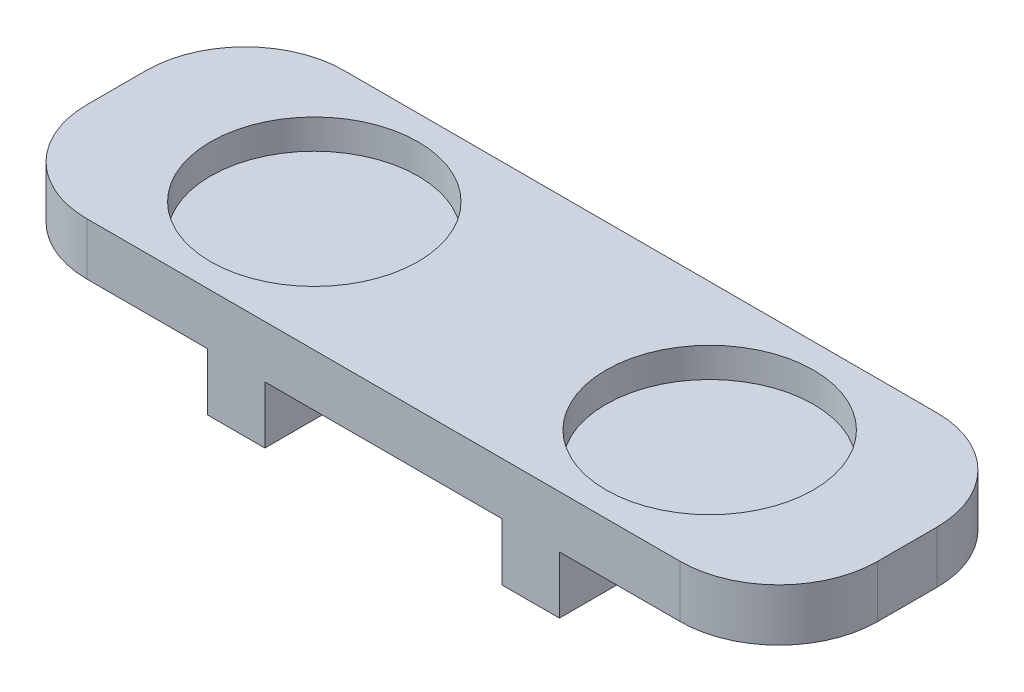
ISO-10303-21;
HEADER;
FILE_DESCRIPTION(('STEP AP214'),'2;1');
FILE_NAME('part.step','',(''),(''),'','','');
FILE_SCHEMA(('AUTOMOTIVE_DESIGN { 1 0 10303 214 1 1 1 1 }'));
ENDSEC;
DATA;
#1=APPLICATION_CONTEXT('core data for automotive mechanical design processes');
#2=APPLICATION_PROTOCOL_DEFINITION('international standard','automotive_design',2000,#1);
#3=PRODUCT_CONTEXT('',#1,'mechanical');
#4=PRODUCT('Part','Part','',(#3));
#5=PRODUCT_RELATED_PRODUCT_CATEGORY('part','',(#4));
#6=PRODUCT_DEFINITION_FORMATION('','',#4);
#7=PRODUCT_DEFINITION_CONTEXT('part definition',#1,'design');
#8=PRODUCT_DEFINITION('design','',#6,#7);
#9=PRODUCT_DEFINITION_SHAPE('','',#8);
#10=(LENGTH_UNIT() NAMED_UNIT(*) SI_UNIT(.MILLI.,.METRE.));
#11=(NAMED_UNIT(*) PLANE_ANGLE_UNIT() SI_UNIT($,.RADIAN.));
#12=(NAMED_UNIT(*) SI_UNIT($,.STERADIAN.) SOLID_ANGLE_UNIT());
#13=UNCERTAINTY_MEASURE_WITH_UNIT(LENGTH_MEASURE(1.E-05),#10,'distance_accuracy_value','');
#14=(GEOMETRIC_REPRESENTATION_CONTEXT(3) GLOBAL_UNCERTAINTY_ASSIGNED_CONTEXT((#13)) GLOBAL_UNIT_ASSIGNED_CONTEXT((#10,
#11,#12)) REPRESENTATION_CONTEXT('',''));
#15=CARTESIAN_POINT('',(0.,0.,0.));
#16=DIRECTION('',(0.,0.,1.));
#17=DIRECTION('',(1.,0.,0.));
#18=AXIS2_PLACEMENT_3D('',#15,#16,#17);
#19=CARTESIAN_POINT('',(0.,0.,33.02));
#20=DIRECTION('',(0.,-1.,0.));
#21=DIRECTION('',(1.,0.,0.));
#22=AXIS2_PLACEMENT_3D('',#19,#20,#21);
#23=PLANE('',#22);
#24=DIRECTION('',(-1.,0.,0.));
#25=VECTOR('',#24,1.);
#26=CARTESIAN_POINT('',(0.,0.,0.));
#27=LINE('',#26,#25);
#28=CARTESIAN_POINT('',(102.102268650145,0.,0.));
#29=VERTEX_POINT('',#28);
#30=CARTESIAN_POINT('',(86.6082686501452,0.,0.));
#31=VERTEX_POINT('',#30);
#32=EDGE_CURVE('E200',#29,#31,#27,.T.);
#33=ORIENTED_EDGE('',*,*,#32,.F.);
#34=CARTESIAN_POINT('',(102.102268650145,0.,12.7));
#35=DIRECTION('',(0.,-1.,0.));
#36=DIRECTION('',(1.,0.,0.));
#37=AXIS2_PLACEMENT_3D('',#34,#35,#36);
#38=CIRCLE('',#37,12.7);
#39=CARTESIAN_POINT('',(114.802268650145,0.,12.7));
#40=VERTEX_POINT('',#39);
#41=EDGE_CURVE('E253',#29,#40,#38,.T.);
#42=ORIENTED_EDGE('',*,*,#41,.T.);
#43=DIRECTION('',(0.,0.,-1.));
#44=VECTOR('',#43,1.);
#45=CARTESIAN_POINT('',(114.802268650145,0.,33.02));
#46=LINE('',#45,#44);
#47=CARTESIAN_POINT('',(114.802268650145,0.,20.32));
#48=VERTEX_POINT('',#47);
#49=EDGE_CURVE('E242',#48,#40,#46,.T.);
#50=ORIENTED_EDGE('',*,*,#49,.F.);
#51=CARTESIAN_POINT('',(102.102268650145,0.,20.32));
#52=DIRECTION('',(0.,-1.,0.));
#53=DIRECTION('',(1.,0.,0.));
#54=AXIS2_PLACEMENT_3D('',#51,#52,#53);
#55=CIRCLE('',#54,12.7);
#56=CARTESIAN_POINT('',(102.102268650145,0.,33.02));
#57=VERTEX_POINT('',#56);
#58=EDGE_CURVE('E251',#48,#57,#55,.T.);
#59=ORIENTED_EDGE('',*,*,#58,.T.);
#60=DIRECTION('',(-1.,0.,0.));
#61=VECTOR('',#60,1.);
#62=CARTESIAN_POINT('',(0.,0.,33.02));
#63=LINE('',#62,#61);
#64=CARTESIAN_POINT('',(86.6082686501452,0.,33.02));
#65=VERTEX_POINT('',#64);
#66=EDGE_CURVE('E176',#57,#65,#63,.T.);
#67=ORIENTED_EDGE('',*,*,#66,.T.);
#68=DIRECTION('',(0.,0.,-1.));
#69=VECTOR('',#68,1.);
#70=CARTESIAN_POINT('',(86.6082686501452,0.,33.02));
#71=LINE('',#70,#69);
#72=EDGE_CURVE('E199',#65,#31,#71,.T.);
#73=ORIENTED_EDGE('',*,*,#72,.T.);
#74=EDGE_LOOP('',(#33,#42,#50,#59,#67,#73));
#75=FACE_BOUND('',#74,.T.);
#76=ADVANCED_FACE('F37',(#75),#23,.T.);
#77=CARTESIAN_POINT('',(114.802268650145,0.,33.02));
#78=DIRECTION('',(1.,0.,0.));
#79=DIRECTION('',(0.,0.,-1.));
#80=AXIS2_PLACEMENT_3D('',#77,#78,#79);
#81=PLANE('',#80);
#82=ORIENTED_EDGE('',*,*,#49,.T.);
#83=DIRECTION('',(0.,-1.,0.));
#84=VECTOR('',#83,1.);
#85=CARTESIAN_POINT('',(114.802268650145,6.70926848629316,12.7));
#86=LINE('',#85,#84);
#87=CARTESIAN_POINT('',(114.802268650145,6.70926848629316,12.7));
#88=VERTEX_POINT('',#87);
#89=EDGE_CURVE('E258',#40,#88,#86,.F.);
#90=ORIENTED_EDGE('',*,*,#89,.T.);
#91=DIRECTION('',(0.,0.,-1.));
#92=VECTOR('',#91,1.);
#93=CARTESIAN_POINT('',(114.802268650145,6.70926848629316,33.02));
#94=LINE('',#93,#92);
#95=CARTESIAN_POINT('',(114.802268650145,6.70926848629316,20.32));
#96=VERTEX_POINT('',#95);
#97=EDGE_CURVE('E239',#96,#88,#94,.T.);
#98=ORIENTED_EDGE('',*,*,#97,.F.);
#99=DIRECTION('',(0.,-1.,0.));
#100=VECTOR('',#99,1.);
#101=CARTESIAN_POINT('',(114.802268650145,0.,20.32));
#102=LINE('',#101,#100);
#103=EDGE_CURVE('E255',#96,#48,#102,.T.);
#104=ORIENTED_EDGE('',*,*,#103,.T.);
#105=EDGE_LOOP('',(#82,#90,#98,#104));
#106=FACE_BOUND('',#105,.T.);
#107=ADVANCED_FACE('F320',(#106),#81,.T.);
#108=CARTESIAN_POINT('',(0.,6.70926848629316,33.02));
#109=DIRECTION('',(0.,1.,0.));
#110=DIRECTION('',(0.,0.,1.));
#111=AXIS2_PLACEMENT_3D('',#108,#109,#110);
#112=PLANE('',#111);
#113=CARTESIAN_POINT('',(38.6022686501452,6.70926848629316,16.51));
#114=DIRECTION('',(0.,1.,0.));
#115=DIRECTION('',(0.,0.,1.));
#116=AXIS2_PLACEMENT_3D('',#113,#114,#115);
#117=CIRCLE('',#116,13.335);
#118=CARTESIAN_POINT('',(38.6022686501452,6.70926848629316,29.845));
#119=VERTEX_POINT('',#118);
#120=EDGE_CURVE('E607',#119,#119,#117,.T.);
#121=ORIENTED_EDGE('',*,*,#120,.F.);
#122=EDGE_LOOP('',(#121));
#123=FACE_BOUND('',#122,.T.);
#124=CARTESIAN_POINT('',(89.4022686501452,6.70926848629316,16.51));
#125=DIRECTION('',(0.,1.,0.));
#126=DIRECTION('',(0.,0.,1.));
#127=AXIS2_PLACEMENT_3D('',#124,#125,#126);
#128=CIRCLE('',#127,13.335);
#129=CARTESIAN_POINT('',(89.4022686501452,6.70926848629316,29.845));
#130=VERTEX_POINT('',#129);
#131=EDGE_CURVE('E605',#130,#130,#128,.T.);
#132=ORIENTED_EDGE('',*,*,#131,.F.);
#133=EDGE_LOOP('',(#132));
#134=FACE_BOUND('',#133,.T.);
#135=ORIENTED_EDGE('',*,*,#97,.T.);
#136=CARTESIAN_POINT('',(102.102268650145,6.70926848629316,12.7));
#137=DIRECTION('',(0.,1.,0.));
#138=DIRECTION('',(0.,0.,1.));
#139=AXIS2_PLACEMENT_3D('',#136,#137,#138);
#140=CIRCLE('',#139,12.7);
#141=CARTESIAN_POINT('',(102.102268650145,6.70926848629316,0.));
#142=VERTEX_POINT('',#141);
#143=EDGE_CURVE('E266',#88,#142,#140,.T.);
#144=ORIENTED_EDGE('',*,*,#143,.T.);
#145=DIRECTION('',(1.,0.,0.));
#146=VECTOR('',#145,1.);
#147=CARTESIAN_POINT('',(0.,6.70926848629316,0.));
#148=LINE('',#147,#146);
#149=CARTESIAN_POINT('',(25.9022686501452,6.70926848629316,0.));
#150=VERTEX_POINT('',#149);
#151=EDGE_CURVE('E202',#150,#142,#148,.T.);
#152=ORIENTED_EDGE('',*,*,#151,.F.);
#153=CARTESIAN_POINT('',(25.9022686501452,6.70926848629316,12.7));
#154=DIRECTION('',(0.,1.,0.));
#155=DIRECTION('',(0.,0.,1.));
#156=AXIS2_PLACEMENT_3D('',#153,#154,#155);
#157=CIRCLE('',#156,12.7);
#158=CARTESIAN_POINT('',(13.2022686501452,6.70926848629316,12.7));
#159=VERTEX_POINT('',#158);
#160=EDGE_CURVE('E262',#150,#159,#157,.T.);
#161=ORIENTED_EDGE('',*,*,#160,.T.);
#162=DIRECTION('',(0.,0.,-1.));
#163=VECTOR('',#162,1.);
#164=CARTESIAN_POINT('',(13.2022686501452,6.70926848629316,33.02));
#165=LINE('',#164,#163);
#166=CARTESIAN_POINT('',(13.2022686501452,6.70926848629316,20.32));
#167=VERTEX_POINT('',#166);
#168=EDGE_CURVE('E237',#167,#159,#165,.T.);
#169=ORIENTED_EDGE('',*,*,#168,.F.);
#170=CARTESIAN_POINT('',(25.9022686501452,6.70926848629316,20.32));
#171=DIRECTION('',(0.,1.,0.));
#172=DIRECTION('',(0.,0.,1.));
#173=AXIS2_PLACEMENT_3D('',#170,#171,#172);
#174=CIRCLE('',#173,12.7);
#175=CARTESIAN_POINT('',(25.9022686501452,6.70926848629316,33.02));
#176=VERTEX_POINT('',#175);
#177=EDGE_CURVE('E260',#167,#176,#174,.T.);
#178=ORIENTED_EDGE('',*,*,#177,.T.);
#179=DIRECTION('',(1.,0.,0.));
#180=VECTOR('',#179,1.);
#181=CARTESIAN_POINT('',(0.,6.70926848629316,33.02));
#182=LINE('',#181,#180);
#183=CARTESIAN_POINT('',(102.102268650145,6.70926848629316,33.02));
#184=VERTEX_POINT('',#183);
#185=EDGE_CURVE('E174',#176,#184,#182,.T.);
#186=ORIENTED_EDGE('',*,*,#185,.T.);
#187=CARTESIAN_POINT('',(102.102268650145,6.70926848629316,20.32));
#188=DIRECTION('',(0.,1.,0.));
#189=DIRECTION('',(0.,0.,1.));
#190=AXIS2_PLACEMENT_3D('',#187,#188,#189);
#191=CIRCLE('',#190,12.7);
#192=EDGE_CURVE('E264',#184,#96,#191,.T.);
#193=ORIENTED_EDGE('',*,*,#192,.T.);
#194=EDGE_LOOP('',(#135,#144,#152,#161,#169,#178,#186,#193));
#195=FACE_BOUND('',#194,.T.);
#196=ADVANCED_FACE('F279',(#123,#134,#195),#112,.T.);
#197=CARTESIAN_POINT('',(13.2022686501452,0.,33.02));
#198=DIRECTION('',(-1.,0.,0.));
#199=DIRECTION('',(0.,0.,1.));
#200=AXIS2_PLACEMENT_3D('',#197,#198,#199);
#201=PLANE('',#200);
#202=ORIENTED_EDGE('',*,*,#168,.T.);
#203=DIRECTION('',(0.,1.,0.));
#204=VECTOR('',#203,1.);
#205=CARTESIAN_POINT('',(13.2022686501452,0.,12.7));
#206=LINE('',#205,#204);
#207=CARTESIAN_POINT('',(13.2022686501452,0.,12.7));
#208=VERTEX_POINT('',#207);
#209=EDGE_CURVE('E52',#159,#208,#206,.F.);
#210=ORIENTED_EDGE('',*,*,#209,.T.);
#211=DIRECTION('',(0.,0.,-1.));
#212=VECTOR('',#211,1.);
#213=CARTESIAN_POINT('',(13.2022686501452,0.,33.02));
#214=LINE('',#213,#212);
#215=CARTESIAN_POINT('',(13.2022686501452,0.,20.32));
#216=VERTEX_POINT('',#215);
#217=EDGE_CURVE('E158',#216,#208,#214,.T.);
#218=ORIENTED_EDGE('',*,*,#217,.F.);
#219=DIRECTION('',(0.,1.,0.));
#220=VECTOR('',#219,1.);
#221=CARTESIAN_POINT('',(13.2022686501452,0.,20.32));
#222=LINE('',#221,#220);
#223=EDGE_CURVE('E271',#216,#167,#222,.T.);
#224=ORIENTED_EDGE('',*,*,#223,.T.);
#225=EDGE_LOOP('',(#202,#210,#218,#224));
#226=FACE_BOUND('',#225,.T.);
#227=ADVANCED_FACE('F276',(#226),#201,.T.);
#228=ORIENTED_EDGE('',*,*,#217,.T.);
#229=CARTESIAN_POINT('',(25.9022686501452,0.,12.7));
#230=DIRECTION('',(0.,-1.,0.));
#231=DIRECTION('',(1.,0.,0.));
#232=AXIS2_PLACEMENT_3D('',#229,#230,#231);
#233=CIRCLE('',#232,12.7);
#234=CARTESIAN_POINT('',(25.9022686501452,0.,0.));
#235=VERTEX_POINT('',#234);
#236=EDGE_CURVE('E11',#208,#235,#233,.T.);
#237=ORIENTED_EDGE('',*,*,#236,.T.);
#238=CARTESIAN_POINT('',(41.3962686501452,0.,0.));
#239=VERTEX_POINT('',#238);
#240=EDGE_CURVE('E154',#239,#235,#27,.T.);
#241=ORIENTED_EDGE('',*,*,#240,.F.);
#242=DIRECTION('',(0.,0.,-1.));
#243=VECTOR('',#242,1.);
#244=CARTESIAN_POINT('',(41.3962686501452,0.,33.02));
#245=LINE('',#244,#243);
#246=CARTESIAN_POINT('',(41.3962686501452,0.,33.02));
#247=VERTEX_POINT('',#246);
#248=EDGE_CURVE('E148',#247,#239,#245,.T.);
#249=ORIENTED_EDGE('',*,*,#248,.F.);
#250=CARTESIAN_POINT('',(25.9022686501452,0.,33.02));
#251=VERTEX_POINT('',#250);
#252=EDGE_CURVE('E152',#247,#251,#63,.T.);
#253=ORIENTED_EDGE('',*,*,#252,.T.);
#254=CARTESIAN_POINT('',(25.9022686501452,0.,20.32));
#255=DIRECTION('',(0.,-1.,0.));
#256=DIRECTION('',(1.,0.,0.));
#257=AXIS2_PLACEMENT_3D('',#254,#255,#256);
#258=CIRCLE('',#257,12.7);
#259=EDGE_CURVE('E45',#251,#216,#258,.T.);
#260=ORIENTED_EDGE('',*,*,#259,.T.);
#261=EDGE_LOOP('',(#228,#237,#241,#249,#253,#260));
#262=FACE_BOUND('',#261,.T.);
#263=ADVANCED_FACE('F150',(#262),#23,.T.);
#264=CARTESIAN_POINT('',(41.3962686501452,0.,33.02));
#265=DIRECTION('',(1.,0.,0.));
#266=DIRECTION('',(0.,0.,-1.));
#267=AXIS2_PLACEMENT_3D('',#264,#265,#266);
#268=PLANE('',#267);
#269=DIRECTION('',(0.,-1.,0.));
#270=VECTOR('',#269,1.);
#271=CARTESIAN_POINT('',(41.3962686501452,0.,0.));
#272=LINE('',#271,#270);
#273=CARTESIAN_POINT('',(41.3962686501452,-7.366,0.));
#274=VERTEX_POINT('',#273);
#275=EDGE_CURVE('E207',#239,#274,#272,.T.);
#276=ORIENTED_EDGE('',*,*,#275,.T.);
#277=DIRECTION('',(0.,0.,-1.));
#278=VECTOR('',#277,1.);
#279=CARTESIAN_POINT('',(41.3962686501452,-7.366,33.02));
#280=LINE('',#279,#278);
#281=CARTESIAN_POINT('',(41.3962686501452,-7.366,33.02));
#282=VERTEX_POINT('',#281);
#283=EDGE_CURVE('E159',#282,#274,#280,.T.);
#284=ORIENTED_EDGE('',*,*,#283,.F.);
#285=DIRECTION('',(0.,-1.,0.));
#286=VECTOR('',#285,1.);
#287=CARTESIAN_POINT('',(41.3962686501452,0.,33.02));
#288=LINE('',#287,#286);
#289=EDGE_CURVE('E162',#247,#282,#288,.T.);
#290=ORIENTED_EDGE('',*,*,#289,.F.);
#291=ORIENTED_EDGE('',*,*,#248,.T.);
#292=EDGE_LOOP('',(#276,#284,#290,#291));
#293=FACE_BOUND('',#292,.T.);
#294=ADVANCED_FACE('F163',(#293),#268,.F.);
#295=CARTESIAN_POINT('',(0.,-7.366,33.02));
#296=DIRECTION('',(0.,-1.,0.));
#297=DIRECTION('',(0.,0.,-1.));
#298=AXIS2_PLACEMENT_3D('',#295,#296,#297);
#299=PLANE('',#298);
#300=DIRECTION('',(-1.,0.,0.));
#301=VECTOR('',#300,1.);
#302=CARTESIAN_POINT('',(0.,-7.366,0.));
#303=LINE('',#302,#301);
#304=CARTESIAN_POINT('',(48.7622686501452,-7.366,0.));
#305=VERTEX_POINT('',#304);
#306=EDGE_CURVE('E209',#305,#274,#303,.T.);
#307=ORIENTED_EDGE('',*,*,#306,.F.);
#308=DIRECTION('',(0.,0.,-1.));
#309=VECTOR('',#308,1.);
#310=CARTESIAN_POINT('',(48.7622686501452,-7.366,33.02));
#311=LINE('',#310,#309);
#312=CARTESIAN_POINT('',(48.7622686501452,-7.366,33.02));
#313=VERTEX_POINT('',#312);
#314=EDGE_CURVE('E233',#313,#305,#311,.T.);
#315=ORIENTED_EDGE('',*,*,#314,.F.);
#316=DIRECTION('',(-1.,0.,0.));
#317=VECTOR('',#316,1.);
#318=CARTESIAN_POINT('',(0.,-7.366,33.02));
#319=LINE('',#318,#317);
#320=EDGE_CURVE('E167',#313,#282,#319,.T.);
#321=ORIENTED_EDGE('',*,*,#320,.T.);
#322=ORIENTED_EDGE('',*,*,#283,.T.);
#323=EDGE_LOOP('',(#307,#315,#321,#322));
#324=FACE_BOUND('',#323,.T.);
#325=ADVANCED_FACE('F298',(#324),#299,.T.);
#326=CARTESIAN_POINT('',(48.7622686501452,0.,33.02));
#327=DIRECTION('',(1.,0.,0.));
#328=DIRECTION('',(0.,0.,-1.));
#329=AXIS2_PLACEMENT_3D('',#326,#327,#328);
#330=PLANE('',#329);
#331=DIRECTION('',(0.,-1.,0.));
#332=VECTOR('',#331,1.);
#333=CARTESIAN_POINT('',(48.7622686501452,0.,0.));
#334=LINE('',#333,#332);
#335=CARTESIAN_POINT('',(48.7622686501452,0.,0.));
#336=VERTEX_POINT('',#335);
#337=EDGE_CURVE('E212',#336,#305,#334,.T.);
#338=ORIENTED_EDGE('',*,*,#337,.F.);
#339=DIRECTION('',(0.,0.,-1.));
#340=VECTOR('',#339,1.);
#341=CARTESIAN_POINT('',(48.7622686501452,0.,33.02));
#342=LINE('',#341,#340);
#343=CARTESIAN_POINT('',(48.7622686501452,0.,33.02));
#344=VERTEX_POINT('',#343);
#345=EDGE_CURVE('E231',#344,#336,#342,.T.);
#346=ORIENTED_EDGE('',*,*,#345,.F.);
#347=DIRECTION('',(0.,-1.,0.));
#348=VECTOR('',#347,1.);
#349=CARTESIAN_POINT('',(48.7622686501452,0.,33.02));
#350=LINE('',#349,#348);
#351=EDGE_CURVE('E184',#344,#313,#350,.T.);
#352=ORIENTED_EDGE('',*,*,#351,.T.);
#353=ORIENTED_EDGE('',*,*,#314,.T.);
#354=EDGE_LOOP('',(#338,#346,#352,#353));
#355=FACE_BOUND('',#354,.T.);
#356=ADVANCED_FACE('F295',(#355),#330,.T.);
#357=CARTESIAN_POINT('',(79.2422686501452,0.,0.));
#358=VERTEX_POINT('',#357);
#359=EDGE_CURVE('E204',#358,#336,#27,.T.);
#360=ORIENTED_EDGE('',*,*,#359,.F.);
#361=DIRECTION('',(0.,0.,-1.));
#362=VECTOR('',#361,1.);
#363=CARTESIAN_POINT('',(79.2422686501452,0.,33.02));
#364=LINE('',#363,#362);
#365=CARTESIAN_POINT('',(79.2422686501452,0.,33.02));
#366=VERTEX_POINT('',#365);
#367=EDGE_CURVE('E229',#366,#358,#364,.T.);
#368=ORIENTED_EDGE('',*,*,#367,.F.);
#369=EDGE_CURVE('E177',#366,#344,#63,.T.);
#370=ORIENTED_EDGE('',*,*,#369,.T.);
#371=ORIENTED_EDGE('',*,*,#345,.T.);
#372=EDGE_LOOP('',(#360,#368,#370,#371));
#373=FACE_BOUND('',#372,.T.);
#374=ADVANCED_FACE('F293',(#373),#23,.T.);
#375=CARTESIAN_POINT('',(79.2422686501452,0.,33.02));
#376=DIRECTION('',(1.,0.,0.));
#377=DIRECTION('',(0.,0.,-1.));
#378=AXIS2_PLACEMENT_3D('',#375,#376,#377);
#379=PLANE('',#378);
#380=DIRECTION('',(0.,-1.,0.));
#381=VECTOR('',#380,1.);
#382=CARTESIAN_POINT('',(79.2422686501452,0.,0.));
#383=LINE('',#382,#381);
#384=CARTESIAN_POINT('',(79.2422686501452,-7.366,0.));
#385=VERTEX_POINT('',#384);
#386=EDGE_CURVE('E215',#358,#385,#383,.T.);
#387=ORIENTED_EDGE('',*,*,#386,.T.);
#388=DIRECTION('',(0.,0.,-1.));
#389=VECTOR('',#388,1.);
#390=CARTESIAN_POINT('',(79.2422686501452,-7.366,33.02));
#391=LINE('',#390,#389);
#392=CARTESIAN_POINT('',(79.2422686501452,-7.366,33.02));
#393=VERTEX_POINT('',#392);
#394=EDGE_CURVE('E226',#393,#385,#391,.T.);
#395=ORIENTED_EDGE('',*,*,#394,.F.);
#396=DIRECTION('',(0.,-1.,0.));
#397=VECTOR('',#396,1.);
#398=CARTESIAN_POINT('',(79.2422686501452,0.,33.02));
#399=LINE('',#398,#397);
#400=EDGE_CURVE('E183',#366,#393,#399,.T.);
#401=ORIENTED_EDGE('',*,*,#400,.F.);
#402=ORIENTED_EDGE('',*,*,#367,.T.);
#403=EDGE_LOOP('',(#387,#395,#401,#402));
#404=FACE_BOUND('',#403,.T.);
#405=ADVANCED_FACE('F304',(#404),#379,.F.);
#406=CARTESIAN_POINT('',(0.,-7.366,33.02));
#407=DIRECTION('',(0.,1.,0.));
#408=DIRECTION('',(0.,0.,1.));
#409=AXIS2_PLACEMENT_3D('',#406,#407,#408);
#410=PLANE('',#409);
#411=DIRECTION('',(1.,0.,0.));
#412=VECTOR('',#411,1.);
#413=CARTESIAN_POINT('',(0.,-7.366,0.));
#414=LINE('',#413,#412);
#415=CARTESIAN_POINT('',(86.6082686501452,-7.366,0.));
#416=VERTEX_POINT('',#415);
#417=EDGE_CURVE('E217',#385,#416,#414,.T.);
#418=ORIENTED_EDGE('',*,*,#417,.T.);
#419=DIRECTION('',(0.,0.,-1.));
#420=VECTOR('',#419,1.);
#421=CARTESIAN_POINT('',(86.6082686501452,-7.366,33.02));
#422=LINE('',#421,#420);
#423=CARTESIAN_POINT('',(86.6082686501452,-7.366,33.02));
#424=VERTEX_POINT('',#423);
#425=EDGE_CURVE('E224',#424,#416,#422,.T.);
#426=ORIENTED_EDGE('',*,*,#425,.F.);
#427=DIRECTION('',(1.,0.,0.));
#428=VECTOR('',#427,1.);
#429=CARTESIAN_POINT('',(0.,-7.366,33.02));
#430=LINE('',#429,#428);
#431=EDGE_CURVE('E187',#393,#424,#430,.T.);
#432=ORIENTED_EDGE('',*,*,#431,.F.);
#433=ORIENTED_EDGE('',*,*,#394,.T.);
#434=EDGE_LOOP('',(#418,#426,#432,#433));
#435=FACE_BOUND('',#434,.T.);
#436=ADVANCED_FACE('F306',(#435),#410,.F.);
#437=CARTESIAN_POINT('',(86.6082686501452,0.,33.02));
#438=DIRECTION('',(1.,0.,0.));
#439=DIRECTION('',(0.,0.,-1.));
#440=AXIS2_PLACEMENT_3D('',#437,#438,#439);
#441=PLANE('',#440);
#442=DIRECTION('',(0.,-1.,0.));
#443=VECTOR('',#442,1.);
#444=CARTESIAN_POINT('',(86.6082686501452,0.,0.));
#445=LINE('',#444,#443);
#446=EDGE_CURVE('E181',#31,#416,#445,.T.);
#447=ORIENTED_EDGE('',*,*,#446,.F.);
#448=ORIENTED_EDGE('',*,*,#72,.F.);
#449=DIRECTION('',(0.,-1.,0.));
#450=VECTOR('',#449,1.);
#451=CARTESIAN_POINT('',(86.6082686501452,0.,33.02));
#452=LINE('',#451,#450);
#453=EDGE_CURVE('E196',#65,#424,#452,.T.);
#454=ORIENTED_EDGE('',*,*,#453,.T.);
#455=ORIENTED_EDGE('',*,*,#425,.T.);
#456=EDGE_LOOP('',(#447,#448,#454,#455));
#457=FACE_BOUND('',#456,.T.);
#458=ADVANCED_FACE('F310',(#457),#441,.T.);
#459=CARTESIAN_POINT('',(0.,0.,33.02));
#460=DIRECTION('',(0.,0.,1.));
#461=DIRECTION('',(1.,0.,0.));
#462=AXIS2_PLACEMENT_3D('',#459,#460,#461);
#463=PLANE('',#462);
#464=ORIENTED_EDGE('',*,*,#66,.F.);
#465=DIRECTION('',(0.,-1.,0.));
#466=VECTOR('',#465,1.);
#467=CARTESIAN_POINT('',(102.102268650145,0.,33.02));
#468=LINE('',#467,#466);
#469=EDGE_CURVE('E269',#57,#184,#468,.F.);
#470=ORIENTED_EDGE('',*,*,#469,.T.);
#471=ORIENTED_EDGE('',*,*,#185,.F.);
#472=DIRECTION('',(0.,1.,0.));
#473=VECTOR('',#472,1.);
#474=CARTESIAN_POINT('',(25.9022686501452,0.,33.02));
#475=LINE('',#474,#473);
#476=EDGE_CURVE('E173',#176,#251,#475,.F.);
#477=ORIENTED_EDGE('',*,*,#476,.T.);
#478=ORIENTED_EDGE('',*,*,#252,.F.);
#479=ORIENTED_EDGE('',*,*,#289,.T.);
#480=ORIENTED_EDGE('',*,*,#320,.F.);
#481=ORIENTED_EDGE('',*,*,#351,.F.);
#482=ORIENTED_EDGE('',*,*,#369,.F.);
#483=ORIENTED_EDGE('',*,*,#400,.T.);
#484=ORIENTED_EDGE('',*,*,#431,.T.);
#485=ORIENTED_EDGE('',*,*,#453,.F.);
#486=EDGE_LOOP('',(#464,#470,#471,#477,#478,#479,#480,#481,#482,#483,#484,#485));
#487=FACE_BOUND('',#486,.T.);
#488=ADVANCED_FACE('F170',(#487),#463,.T.);
#489=CARTESIAN_POINT('',(0.,0.,0.));
#490=DIRECTION('',(0.,0.,1.));
#491=DIRECTION('',(1.,0.,0.));
#492=AXIS2_PLACEMENT_3D('',#489,#490,#491);
#493=PLANE('',#492);
#494=ORIENTED_EDGE('',*,*,#151,.T.);
#495=DIRECTION('',(0.,-1.,0.));
#496=VECTOR('',#495,1.);
#497=CARTESIAN_POINT('',(102.102268650145,0.,0.));
#498=LINE('',#497,#496);
#499=EDGE_CURVE('E248',#142,#29,#498,.T.);
#500=ORIENTED_EDGE('',*,*,#499,.T.);
#501=ORIENTED_EDGE('',*,*,#32,.T.);
#502=ORIENTED_EDGE('',*,*,#446,.T.);
#503=ORIENTED_EDGE('',*,*,#417,.F.);
#504=ORIENTED_EDGE('',*,*,#386,.F.);
#505=ORIENTED_EDGE('',*,*,#359,.T.);
#506=ORIENTED_EDGE('',*,*,#337,.T.);
#507=ORIENTED_EDGE('',*,*,#306,.T.);
#508=ORIENTED_EDGE('',*,*,#275,.F.);
#509=ORIENTED_EDGE('',*,*,#240,.T.);
#510=DIRECTION('',(0.,1.,0.));
#511=VECTOR('',#510,1.);
#512=CARTESIAN_POINT('',(25.9022686501452,6.70926848629316,0.));
#513=LINE('',#512,#511);
#514=EDGE_CURVE('E245',#235,#150,#513,.T.);
#515=ORIENTED_EDGE('',*,*,#514,.T.);
#516=EDGE_LOOP('',(#494,#500,#501,#502,#503,#504,#505,#506,#507,#508,#509,#515));
#517=FACE_BOUND('',#516,.T.);
#518=ADVANCED_FACE('F286',(#517),#493,.F.);
#519=CARTESIAN_POINT('',(89.4022686501452,2.89926848629316,16.51));
#520=DIRECTION('',(0.,1.,0.));
#521=DIRECTION('',(0.,0.,1.));
#522=AXIS2_PLACEMENT_3D('',#519,#520,#521);
#523=CYLINDRICAL_SURFACE('',#522,13.335);
#524=CARTESIAN_POINT('',(89.4022686501452,2.89926848629316,16.51));
#525=DIRECTION('',(0.,1.,0.));
#526=DIRECTION('',(0.,0.,1.));
#527=AXIS2_PLACEMENT_3D('',#524,#525,#526);
#528=CIRCLE('',#527,13.335);
#529=CARTESIAN_POINT('',(89.4022686501452,2.89926848629316,29.845));
#530=VERTEX_POINT('',#529);
#531=EDGE_CURVE('E602',#530,#530,#528,.T.);
#532=ORIENTED_EDGE('',*,*,#531,.F.);
#533=EDGE_LOOP('',(#532));
#534=FACE_BOUND('',#533,.T.);
#535=ORIENTED_EDGE('',*,*,#131,.T.);
#536=EDGE_LOOP('',(#535));
#537=FACE_BOUND('',#536,.T.);
#538=ADVANCED_FACE('F393',(#534,#537),#523,.F.);
#539=CARTESIAN_POINT('',(89.4022686501452,2.89926848629316,16.51));
#540=DIRECTION('',(0.,1.,0.));
#541=DIRECTION('',(0.,0.,1.));
#542=AXIS2_PLACEMENT_3D('',#539,#540,#541);
#543=PLANE('',#542);
#544=ORIENTED_EDGE('',*,*,#531,.T.);
#545=EDGE_LOOP('',(#544));
#546=FACE_BOUND('',#545,.T.);
#547=ADVANCED_FACE('F460',(#546),#543,.T.);
#548=CARTESIAN_POINT('',(38.6022686501452,2.89926848629316,16.51));
#549=DIRECTION('',(0.,1.,0.));
#550=DIRECTION('',(0.,0.,1.));
#551=AXIS2_PLACEMENT_3D('',#548,#549,#550);
#552=CYLINDRICAL_SURFACE('',#551,13.335);
#553=CARTESIAN_POINT('',(38.6022686501452,2.89926848629316,16.51));
#554=DIRECTION('',(0.,1.,0.));
#555=DIRECTION('',(0.,0.,1.));
#556=AXIS2_PLACEMENT_3D('',#553,#554,#555);
#557=CIRCLE('',#556,13.335);
#558=CARTESIAN_POINT('',(38.6022686501452,2.89926848629316,29.845));
#559=VERTEX_POINT('',#558);
#560=EDGE_CURVE('E203',#559,#559,#557,.T.);
#561=ORIENTED_EDGE('',*,*,#560,.F.);
#562=EDGE_LOOP('',(#561));
#563=FACE_BOUND('',#562,.T.);
#564=ORIENTED_EDGE('',*,*,#120,.T.);
#565=EDGE_LOOP('',(#564));
#566=FACE_BOUND('',#565,.T.);
#567=ADVANCED_FACE('F449',(#563,#566),#552,.F.);
#568=CARTESIAN_POINT('',(38.6022686501452,2.89926848629316,16.51));
#569=DIRECTION('',(0.,1.,0.));
#570=DIRECTION('',(0.,0.,1.));
#571=AXIS2_PLACEMENT_3D('',#568,#569,#570);
#572=PLANE('',#571);
#573=ORIENTED_EDGE('',*,*,#560,.T.);
#574=EDGE_LOOP('',(#573));
#575=FACE_BOUND('',#574,.T.);
#576=ADVANCED_FACE('F354',(#575),#572,.T.);
#577=CARTESIAN_POINT('',(102.102268650145,0.,12.7));
#578=DIRECTION('',(0.,1.,0.));
#579=DIRECTION('',(0.,0.,1.));
#580=AXIS2_PLACEMENT_3D('',#577,#578,#579);
#581=CYLINDRICAL_SURFACE('',#580,12.7);
#582=ORIENTED_EDGE('',*,*,#143,.F.);
#583=ORIENTED_EDGE('',*,*,#89,.F.);
#584=ORIENTED_EDGE('',*,*,#41,.F.);
#585=ORIENTED_EDGE('',*,*,#499,.F.);
#586=EDGE_LOOP('',(#582,#583,#584,#585));
#587=FACE_BOUND('',#586,.T.);
#588=ADVANCED_FACE('F324',(#587),#581,.T.);
#589=CARTESIAN_POINT('',(102.102268650145,0.,20.32));
#590=DIRECTION('',(0.,-1.,0.));
#591=DIRECTION('',(0.,0.,-1.));
#592=AXIS2_PLACEMENT_3D('',#589,#590,#591);
#593=CYLINDRICAL_SURFACE('',#592,12.7);
#594=ORIENTED_EDGE('',*,*,#192,.F.);
#595=ORIENTED_EDGE('',*,*,#469,.F.);
#596=ORIENTED_EDGE('',*,*,#58,.F.);
#597=ORIENTED_EDGE('',*,*,#103,.F.);
#598=EDGE_LOOP('',(#594,#595,#596,#597));
#599=FACE_BOUND('',#598,.T.);
#600=ADVANCED_FACE('F315',(#599),#593,.T.);
#601=CARTESIAN_POINT('',(25.9022686501452,0.,12.7));
#602=DIRECTION('',(0.,-1.,0.));
#603=DIRECTION('',(0.,0.,-1.));
#604=AXIS2_PLACEMENT_3D('',#601,#602,#603);
#605=CYLINDRICAL_SURFACE('',#604,12.7);
#606=ORIENTED_EDGE('',*,*,#236,.F.);
#607=ORIENTED_EDGE('',*,*,#209,.F.);
#608=ORIENTED_EDGE('',*,*,#160,.F.);
#609=ORIENTED_EDGE('',*,*,#514,.F.);
#610=EDGE_LOOP('',(#606,#607,#608,#609));
#611=FACE_BOUND('',#610,.T.);
#612=ADVANCED_FACE('F284',(#611),#605,.T.);
#613=CARTESIAN_POINT('',(25.9022686501452,0.,20.32));
#614=DIRECTION('',(0.,1.,0.));
#615=DIRECTION('',(0.,0.,1.));
#616=AXIS2_PLACEMENT_3D('',#613,#614,#615);
#617=CYLINDRICAL_SURFACE('',#616,12.7);
#618=ORIENTED_EDGE('',*,*,#259,.F.);
#619=ORIENTED_EDGE('',*,*,#476,.F.);
#620=ORIENTED_EDGE('',*,*,#177,.F.);
#621=ORIENTED_EDGE('',*,*,#223,.F.);
#622=EDGE_LOOP('',(#618,#619,#620,#621));
#623=FACE_BOUND('',#622,.T.);
#624=ADVANCED_FACE('F39',(#623),#617,.T.);
#625=CLOSED_SHELL('',(#76,#107,#196,#227,#263,#294,#325,#356,#374,#405,#436,#458,#488,#518,#538,
#547,#567,#576,#588,#600,#612,#624));
#626=MANIFOLD_SOLID_BREP('B2',#625);
#627=ADVANCED_BREP_SHAPE_REPRESENTATION('',(#18,#626),#14);
#628=SHAPE_DEFINITION_REPRESENTATION(#9,#627);
ENDSEC;
END-ISO-10303-21;
